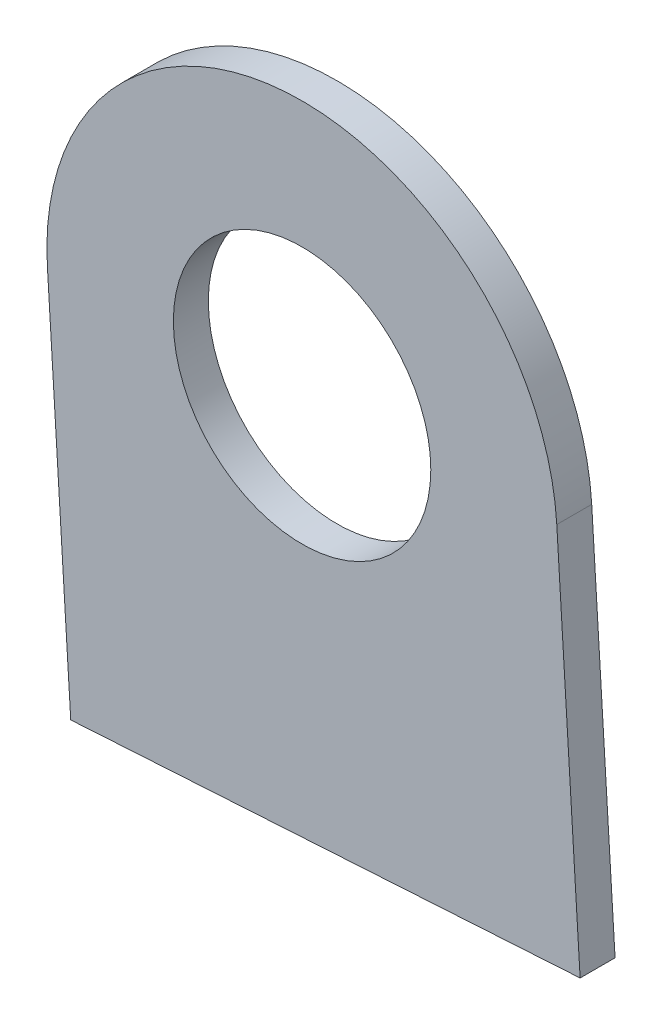
ISO-10303-21;
HEADER;
FILE_DESCRIPTION(('STEP AP214'),'2;1');
FILE_NAME('part.step','',(''),(''),'','','');
FILE_SCHEMA(('AUTOMOTIVE_DESIGN { 1 0 10303 214 1 1 1 1 }'));
ENDSEC;
DATA;
#1=APPLICATION_CONTEXT('core data for automotive mechanical design processes');
#2=APPLICATION_PROTOCOL_DEFINITION('international standard','automotive_design',2000,#1);
#3=PRODUCT_CONTEXT('',#1,'mechanical');
#4=PRODUCT('Part','Part','',(#3));
#5=PRODUCT_RELATED_PRODUCT_CATEGORY('part','',(#4));
#6=PRODUCT_DEFINITION_FORMATION('','',#4);
#7=PRODUCT_DEFINITION_CONTEXT('part definition',#1,'design');
#8=PRODUCT_DEFINITION('design','',#6,#7);
#9=PRODUCT_DEFINITION_SHAPE('','',#8);
#10=(LENGTH_UNIT() NAMED_UNIT(*) SI_UNIT(.MILLI.,.METRE.));
#11=(NAMED_UNIT(*) PLANE_ANGLE_UNIT() SI_UNIT($,.RADIAN.));
#12=(NAMED_UNIT(*) SI_UNIT($,.STERADIAN.) SOLID_ANGLE_UNIT());
#13=UNCERTAINTY_MEASURE_WITH_UNIT(LENGTH_MEASURE(1.E-05),#10,'distance_accuracy_value','');
#14=(GEOMETRIC_REPRESENTATION_CONTEXT(3) GLOBAL_UNCERTAINTY_ASSIGNED_CONTEXT((#13)) GLOBAL_UNIT_ASSIGNED_CONTEXT((#10,
#11,#12)) REPRESENTATION_CONTEXT('',''));
#15=CARTESIAN_POINT('',(0.,0.,0.));
#16=DIRECTION('',(0.,0.,1.));
#17=DIRECTION('',(1.,0.,0.));
#18=AXIS2_PLACEMENT_3D('',#15,#16,#17);
#19=CARTESIAN_POINT('',(0.,0.,780.361907161946));
#20=DIRECTION('',(0.,0.,1.));
#21=DIRECTION('',(1.,0.,0.));
#22=AXIS2_PLACEMENT_3D('',#19,#20,#21);
#23=PLANE('',#22);
#24=CARTESIAN_POINT('',(0.,0.,780.361907161946));
#25=DIRECTION('',(0.,0.,1.));
#26=DIRECTION('',(1.,0.,0.));
#27=AXIS2_PLACEMENT_3D('',#24,#25,#26);
#28=CIRCLE('',#27,21.9053794268558);
#29=CARTESIAN_POINT('',(21.8643712036422,1.33974613410853,780.361907161946));
#30=VERTEX_POINT('',#29);
#31=CARTESIAN_POINT('',(-21.8643712036422,-1.33974613410853,780.361907161946));
#32=VERTEX_POINT('',#31);
#33=EDGE_CURVE('E87',#30,#32,#28,.T.);
#34=ORIENTED_EDGE('',*,*,#33,.T.);
#35=DIRECTION('',(0.0611605993213711,-0.998127938237705,0.));
#36=VECTOR('',#35,1.);
#37=CARTESIAN_POINT('',(-21.8643712036422,-1.33974613410853,780.361907161946));
#38=LINE('',#37,#36);
#39=CARTESIAN_POINT('',(-19.8599322859409,-34.0517618181916,780.361907161946));
#40=VERTEX_POINT('',#39);
#41=EDGE_CURVE('E82',#32,#40,#38,.T.);
#42=ORIENTED_EDGE('',*,*,#41,.T.);
#43=DIRECTION('',(0.998127938237705,0.061160599321371,0.));
#44=VECTOR('',#43,1.);
#45=CARTESIAN_POINT('',(-19.8599322859409,-34.0517618181916,780.361907161946));
#46=LINE('',#45,#44);
#47=CARTESIAN_POINT('',(23.8688101213435,-31.3722695499745,780.361907161946));
#48=VERTEX_POINT('',#47);
#49=EDGE_CURVE('E85',#40,#48,#46,.T.);
#50=ORIENTED_EDGE('',*,*,#49,.T.);
#51=DIRECTION('',(-0.061160599321371,0.998127938237705,0.));
#52=VECTOR('',#51,1.);
#53=CARTESIAN_POINT('',(21.8643712036422,1.33974613410853,780.361907161946));
#54=LINE('',#53,#52);
#55=EDGE_CURVE('E52',#48,#30,#54,.T.);
#56=ORIENTED_EDGE('',*,*,#55,.T.);
#57=EDGE_LOOP('',(#34,#42,#50,#56));
#58=FACE_BOUND('',#57,.T.);
#59=CARTESIAN_POINT('',(0.,0.,780.361907161946));
#60=DIRECTION('',(0.,0.,1.));
#61=DIRECTION('',(1.,0.,0.));
#62=AXIS2_PLACEMENT_3D('',#59,#60,#61);
#63=CIRCLE('',#62,11.0499999999434);
#64=CARTESIAN_POINT('',(11.0499999999434,0.,780.361907161946));
#65=VERTEX_POINT('',#64);
#66=EDGE_CURVE('E102',#65,#65,#63,.T.);
#67=ORIENTED_EDGE('',*,*,#66,.F.);
#68=EDGE_LOOP('',(#67));
#69=FACE_BOUND('',#68,.T.);
#70=ADVANCED_FACE('F35',(#58,#69),#23,.T.);
#71=CARTESIAN_POINT('',(0.,0.,777.361907161946));
#72=DIRECTION('',(0.,0.,1.));
#73=DIRECTION('',(1.,0.,0.));
#74=AXIS2_PLACEMENT_3D('',#71,#72,#73);
#75=PLANE('',#74);
#76=CARTESIAN_POINT('',(0.,0.,777.361907161946));
#77=DIRECTION('',(0.,0.,1.));
#78=DIRECTION('',(1.,0.,0.));
#79=AXIS2_PLACEMENT_3D('',#76,#77,#78);
#80=CIRCLE('',#79,21.9053794268558);
#81=CARTESIAN_POINT('',(21.8643712036422,1.33974613410853,777.361907161946));
#82=VERTEX_POINT('',#81);
#83=CARTESIAN_POINT('',(-21.8643712036422,-1.33974613410853,777.361907161946));
#84=VERTEX_POINT('',#83);
#85=EDGE_CURVE('E99',#82,#84,#80,.T.);
#86=ORIENTED_EDGE('',*,*,#85,.F.);
#87=DIRECTION('',(-0.061160599321371,0.998127938237705,0.));
#88=VECTOR('',#87,1.);
#89=CARTESIAN_POINT('',(21.8643712036422,1.33974613410853,777.361907161946));
#90=LINE('',#89,#88);
#91=CARTESIAN_POINT('',(23.8688101213435,-31.3722695499745,777.361907161946));
#92=VERTEX_POINT('',#91);
#93=EDGE_CURVE('E75',#92,#82,#90,.T.);
#94=ORIENTED_EDGE('',*,*,#93,.F.);
#95=DIRECTION('',(0.998127938237705,0.061160599321371,0.));
#96=VECTOR('',#95,1.);
#97=CARTESIAN_POINT('',(-19.8599322859409,-34.0517618181916,777.361907161946));
#98=LINE('',#97,#96);
#99=CARTESIAN_POINT('',(-19.8599322859409,-34.0517618181916,777.361907161946));
#100=VERTEX_POINT('',#99);
#101=EDGE_CURVE('E69',#100,#92,#98,.T.);
#102=ORIENTED_EDGE('',*,*,#101,.F.);
#103=DIRECTION('',(0.0611605993213711,-0.998127938237705,0.));
#104=VECTOR('',#103,1.);
#105=CARTESIAN_POINT('',(-21.8643712036422,-1.33974613410853,777.361907161946));
#106=LINE('',#105,#104);
#107=EDGE_CURVE('E91',#84,#100,#106,.T.);
#108=ORIENTED_EDGE('',*,*,#107,.F.);
#109=EDGE_LOOP('',(#86,#94,#102,#108));
#110=FACE_BOUND('',#109,.T.);
#111=CARTESIAN_POINT('',(0.,0.,777.361907161946));
#112=DIRECTION('',(0.,0.,1.));
#113=DIRECTION('',(1.,0.,0.));
#114=AXIS2_PLACEMENT_3D('',#111,#112,#113);
#115=CIRCLE('',#114,11.0499999999434);
#116=CARTESIAN_POINT('',(11.0499999999434,0.,777.361907161946));
#117=VERTEX_POINT('',#116);
#118=EDGE_CURVE('E114',#117,#117,#115,.T.);
#119=ORIENTED_EDGE('',*,*,#118,.T.);
#120=EDGE_LOOP('',(#119));
#121=FACE_BOUND('',#120,.T.);
#122=ADVANCED_FACE('F110',(#110,#121),#75,.F.);
#123=CARTESIAN_POINT('',(0.,0.,780.361907161946));
#124=DIRECTION('',(0.,0.,-1.));
#125=DIRECTION('',(-1.,0.,0.));
#126=AXIS2_PLACEMENT_3D('',#123,#124,#125);
#127=CYLINDRICAL_SURFACE('',#126,21.9053794268558);
#128=ORIENTED_EDGE('',*,*,#85,.T.);
#129=DIRECTION('',(0.,0.,-1.));
#130=VECTOR('',#129,1.);
#131=CARTESIAN_POINT('',(-21.8643712036422,-1.33974613410853,780.361907161946));
#132=LINE('',#131,#130);
#133=EDGE_CURVE('E11',#32,#84,#132,.T.);
#134=ORIENTED_EDGE('',*,*,#133,.F.);
#135=ORIENTED_EDGE('',*,*,#33,.F.);
#136=DIRECTION('',(0.,0.,-1.));
#137=VECTOR('',#136,1.);
#138=CARTESIAN_POINT('',(21.8643712036422,1.33974613410853,780.361907161946));
#139=LINE('',#138,#137);
#140=EDGE_CURVE('E95',#30,#82,#139,.T.);
#141=ORIENTED_EDGE('',*,*,#140,.T.);
#142=EDGE_LOOP('',(#128,#134,#135,#141));
#143=FACE_BOUND('',#142,.T.);
#144=ADVANCED_FACE('F37',(#143),#127,.T.);
#145=CARTESIAN_POINT('',(-21.8643712036422,-1.33974613410853,780.361907161946));
#146=DIRECTION('',(0.998127938237704,0.0611605993213711,0.));
#147=DIRECTION('',(-0.0611605993213711,0.998127938237704,0.));
#148=AXIS2_PLACEMENT_3D('',#145,#146,#147);
#149=PLANE('',#148);
#150=ORIENTED_EDGE('',*,*,#107,.T.);
#151=DIRECTION('',(0.,0.,-1.));
#152=VECTOR('',#151,1.);
#153=CARTESIAN_POINT('',(-19.8599322859409,-34.0517618181916,780.361907161946));
#154=LINE('',#153,#152);
#155=EDGE_CURVE('E44',#40,#100,#154,.T.);
#156=ORIENTED_EDGE('',*,*,#155,.F.);
#157=ORIENTED_EDGE('',*,*,#41,.F.);
#158=ORIENTED_EDGE('',*,*,#133,.T.);
#159=EDGE_LOOP('',(#150,#156,#157,#158));
#160=FACE_BOUND('',#159,.T.);
#161=ADVANCED_FACE('F90',(#160),#149,.F.);
#162=CARTESIAN_POINT('',(-19.8599322859409,-34.0517618181916,780.361907161946));
#163=DIRECTION('',(-0.061160599321371,0.998127938237704,0.));
#164=DIRECTION('',(-0.998127938237704,-0.061160599321371,0.));
#165=AXIS2_PLACEMENT_3D('',#162,#163,#164);
#166=PLANE('',#165);
#167=ORIENTED_EDGE('',*,*,#101,.T.);
#168=DIRECTION('',(0.,0.,-1.));
#169=VECTOR('',#168,1.);
#170=CARTESIAN_POINT('',(23.8688101213435,-31.3722695499745,780.361907161946));
#171=LINE('',#170,#169);
#172=EDGE_CURVE('E92',#48,#92,#171,.T.);
#173=ORIENTED_EDGE('',*,*,#172,.F.);
#174=ORIENTED_EDGE('',*,*,#49,.F.);
#175=ORIENTED_EDGE('',*,*,#155,.T.);
#176=EDGE_LOOP('',(#167,#173,#174,#175));
#177=FACE_BOUND('',#176,.T.);
#178=ADVANCED_FACE('F93',(#177),#166,.F.);
#179=CARTESIAN_POINT('',(21.8643712036422,1.33974613410853,780.361907161946));
#180=DIRECTION('',(-0.998127938237704,-0.061160599321371,0.));
#181=DIRECTION('',(0.061160599321371,-0.998127938237704,0.));
#182=AXIS2_PLACEMENT_3D('',#179,#180,#181);
#183=PLANE('',#182);
#184=ORIENTED_EDGE('',*,*,#93,.T.);
#185=ORIENTED_EDGE('',*,*,#140,.F.);
#186=ORIENTED_EDGE('',*,*,#55,.F.);
#187=ORIENTED_EDGE('',*,*,#172,.T.);
#188=EDGE_LOOP('',(#184,#185,#186,#187));
#189=FACE_BOUND('',#188,.T.);
#190=ADVANCED_FACE('F107',(#189),#183,.F.);
#191=CARTESIAN_POINT('',(0.,0.,780.361907161946));
#192=DIRECTION('',(0.,0.,-1.));
#193=DIRECTION('',(-1.,0.,0.));
#194=AXIS2_PLACEMENT_3D('',#191,#192,#193);
#195=CYLINDRICAL_SURFACE('',#194,11.0499999999434);
#196=ORIENTED_EDGE('',*,*,#66,.T.);
#197=EDGE_LOOP('',(#196));
#198=FACE_BOUND('',#197,.T.);
#199=ORIENTED_EDGE('',*,*,#118,.F.);
#200=EDGE_LOOP('',(#199));
#201=FACE_BOUND('',#200,.T.);
#202=ADVANCED_FACE('F120',(#198,#201),#195,.F.);
#203=CLOSED_SHELL('',(#70,#122,#144,#161,#178,#190,#202));
#204=MANIFOLD_SOLID_BREP('B2',#203);
#205=ADVANCED_BREP_SHAPE_REPRESENTATION('',(#18,#204),#14);
#206=SHAPE_DEFINITION_REPRESENTATION(#9,#205);
ENDSEC;
END-ISO-10303-21;
